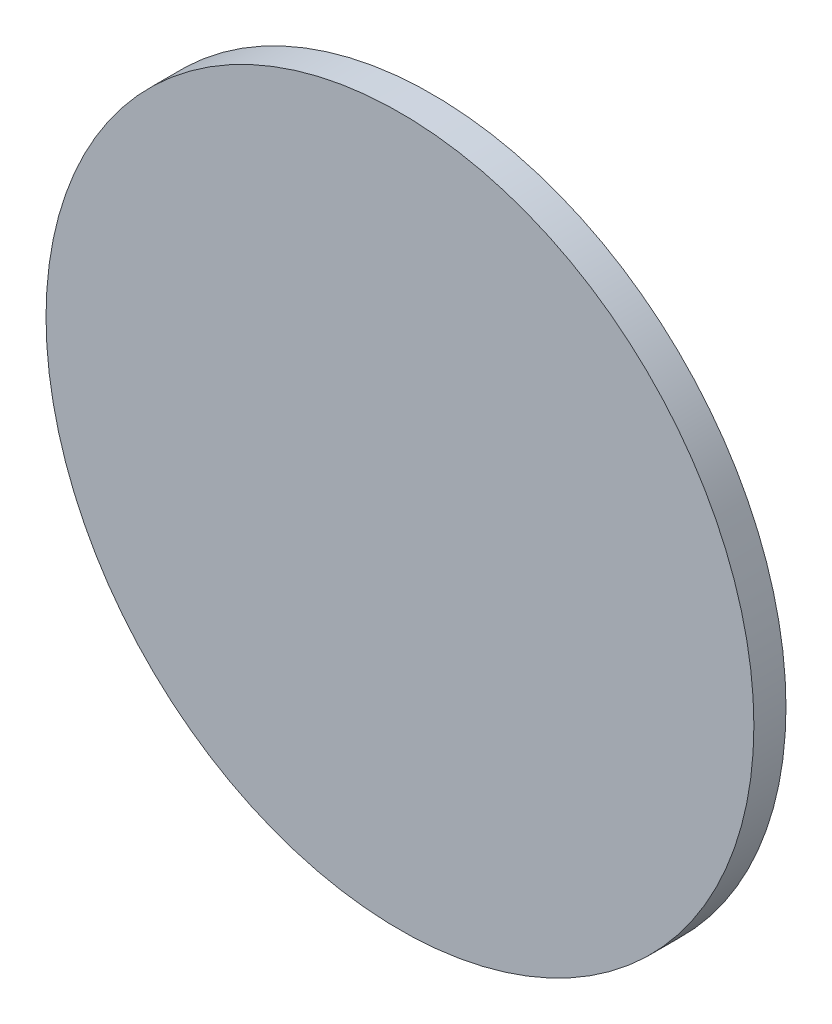
ISO-10303-21;
HEADER;
FILE_DESCRIPTION(('STEP AP214'),'2;1');
FILE_NAME('part.step','',(''),(''),'','','');
FILE_SCHEMA(('AUTOMOTIVE_DESIGN { 1 0 10303 214 1 1 1 1 }'));
ENDSEC;
DATA;
#1=APPLICATION_CONTEXT('core data for automotive mechanical design processes');
#2=APPLICATION_PROTOCOL_DEFINITION('international standard','automotive_design',2000,#1);
#3=PRODUCT_CONTEXT('',#1,'mechanical');
#4=PRODUCT('Part','Part','',(#3));
#5=PRODUCT_RELATED_PRODUCT_CATEGORY('part','',(#4));
#6=PRODUCT_DEFINITION_FORMATION('','',#4);
#7=PRODUCT_DEFINITION_CONTEXT('part definition',#1,'design');
#8=PRODUCT_DEFINITION('design','',#6,#7);
#9=PRODUCT_DEFINITION_SHAPE('','',#8);
#10=(LENGTH_UNIT() NAMED_UNIT(*) SI_UNIT(.MILLI.,.METRE.));
#11=(NAMED_UNIT(*) PLANE_ANGLE_UNIT() SI_UNIT($,.RADIAN.));
#12=(NAMED_UNIT(*) SI_UNIT($,.STERADIAN.) SOLID_ANGLE_UNIT());
#13=UNCERTAINTY_MEASURE_WITH_UNIT(LENGTH_MEASURE(1.E-05),#10,'distance_accuracy_value','');
#14=(GEOMETRIC_REPRESENTATION_CONTEXT(3) GLOBAL_UNCERTAINTY_ASSIGNED_CONTEXT((#13)) GLOBAL_UNIT_ASSIGNED_CONTEXT((#10,
#11,#12)) REPRESENTATION_CONTEXT('',''));
#15=CARTESIAN_POINT('',(0.,0.,0.));
#16=DIRECTION('',(0.,0.,1.));
#17=DIRECTION('',(1.,0.,0.));
#18=AXIS2_PLACEMENT_3D('',#15,#16,#17);
#19=CARTESIAN_POINT('',(0.,0.,6.8));
#20=DIRECTION('',(0.,0.,-1.));
#21=DIRECTION('',(-1.,0.,0.));
#22=AXIS2_PLACEMENT_3D('',#19,#20,#21);
#23=CYLINDRICAL_SURFACE('',#22,75.);
#24=CARTESIAN_POINT('',(0.,0.,6.8));
#25=DIRECTION('',(0.,0.,1.));
#26=DIRECTION('',(1.,0.,0.));
#27=AXIS2_PLACEMENT_3D('',#24,#25,#26);
#28=CIRCLE('',#27,75.);
#29=CARTESIAN_POINT('',(75.,0.,6.8));
#30=VERTEX_POINT('',#29);
#31=EDGE_CURVE('E10',#30,#30,#28,.T.);
#32=ORIENTED_EDGE('',*,*,#31,.F.);
#33=EDGE_LOOP('',(#32));
#34=FACE_BOUND('',#33,.T.);
#35=CARTESIAN_POINT('',(0.,0.,0.));
#36=DIRECTION('',(0.,0.,1.));
#37=DIRECTION('',(1.,0.,0.));
#38=AXIS2_PLACEMENT_3D('',#35,#36,#37);
#39=CIRCLE('',#38,75.);
#40=CARTESIAN_POINT('',(75.,0.,0.));
#41=VERTEX_POINT('',#40);
#42=EDGE_CURVE('E36',#41,#41,#39,.T.);
#43=ORIENTED_EDGE('',*,*,#42,.T.);
#44=EDGE_LOOP('',(#43));
#45=FACE_BOUND('',#44,.T.);
#46=ADVANCED_FACE('F33',(#34,#45),#23,.T.);
#47=CARTESIAN_POINT('',(0.,0.,6.8));
#48=DIRECTION('',(0.,0.,1.));
#49=DIRECTION('',(1.,0.,0.));
#50=AXIS2_PLACEMENT_3D('',#47,#48,#49);
#51=PLANE('',#50);
#52=ORIENTED_EDGE('',*,*,#31,.T.);
#53=EDGE_LOOP('',(#52));
#54=FACE_BOUND('',#53,.T.);
#55=ADVANCED_FACE('F48',(#54),#51,.T.);
#56=CARTESIAN_POINT('',(0.,0.,0.));
#57=DIRECTION('',(0.,0.,1.));
#58=DIRECTION('',(1.,0.,0.));
#59=AXIS2_PLACEMENT_3D('',#56,#57,#58);
#60=PLANE('',#59);
#61=ORIENTED_EDGE('',*,*,#42,.F.);
#62=EDGE_LOOP('',(#61));
#63=FACE_BOUND('',#62,.T.);
#64=ADVANCED_FACE('F46',(#63),#60,.F.);
#65=CLOSED_SHELL('',(#46,#55,#64));
#66=MANIFOLD_SOLID_BREP('B2',#65);
#67=ADVANCED_BREP_SHAPE_REPRESENTATION('',(#18,#66),#14);
#68=SHAPE_DEFINITION_REPRESENTATION(#9,#67);
ENDSEC;
END-ISO-10303-21;
